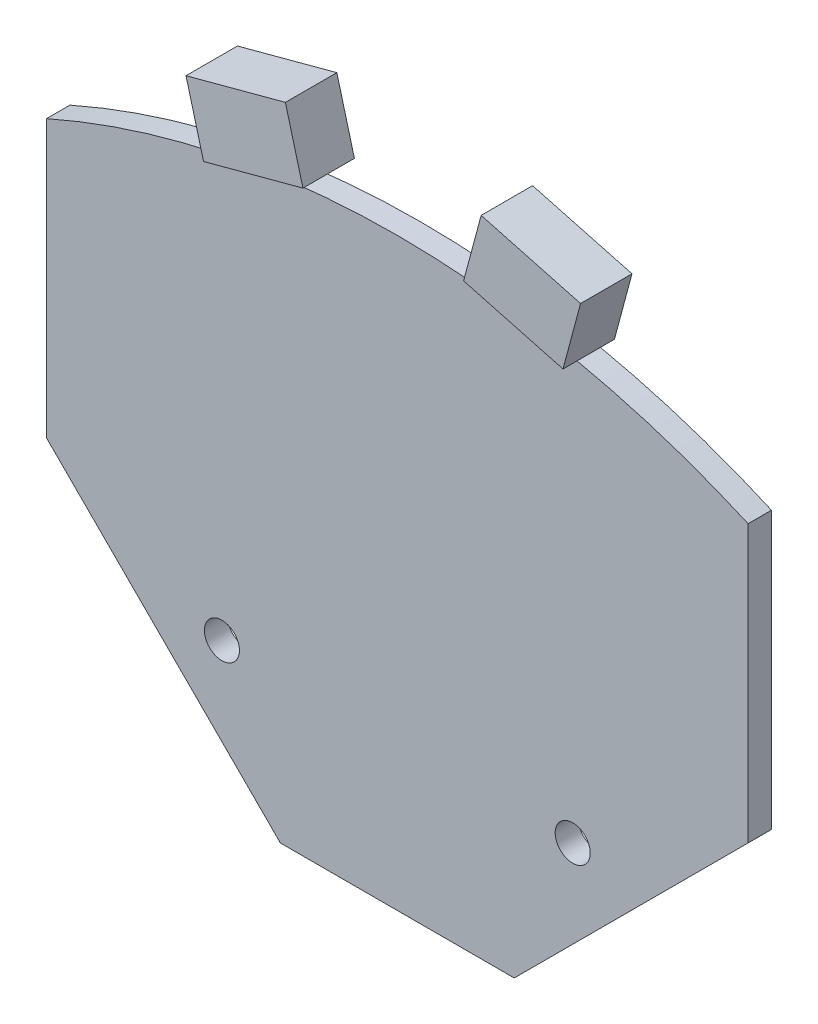
ISO-10303-21;
HEADER;
FILE_DESCRIPTION(('STEP AP214'),'2;1');
FILE_NAME('part.step','',(''),(''),'','','');
FILE_SCHEMA(('AUTOMOTIVE_DESIGN { 1 0 10303 214 1 1 1 1 }'));
ENDSEC;
DATA;
#1=APPLICATION_CONTEXT('core data for automotive mechanical design processes');
#2=APPLICATION_PROTOCOL_DEFINITION('international standard','automotive_design',2000,#1);
#3=PRODUCT_CONTEXT('',#1,'mechanical');
#4=PRODUCT('Part','Part','',(#3));
#5=PRODUCT_RELATED_PRODUCT_CATEGORY('part','',(#4));
#6=PRODUCT_DEFINITION_FORMATION('','',#4);
#7=PRODUCT_DEFINITION_CONTEXT('part definition',#1,'design');
#8=PRODUCT_DEFINITION('design','',#6,#7);
#9=PRODUCT_DEFINITION_SHAPE('','',#8);
#10=(LENGTH_UNIT() NAMED_UNIT(*) SI_UNIT(.MILLI.,.METRE.));
#11=(NAMED_UNIT(*) PLANE_ANGLE_UNIT() SI_UNIT($,.RADIAN.));
#12=(NAMED_UNIT(*) SI_UNIT($,.STERADIAN.) SOLID_ANGLE_UNIT());
#13=UNCERTAINTY_MEASURE_WITH_UNIT(LENGTH_MEASURE(1.E-05),#10,'distance_accuracy_value','');
#14=(GEOMETRIC_REPRESENTATION_CONTEXT(3) GLOBAL_UNCERTAINTY_ASSIGNED_CONTEXT((#13)) GLOBAL_UNIT_ASSIGNED_CONTEXT((#10,
#11,#12)) REPRESENTATION_CONTEXT('',''));
#15=CARTESIAN_POINT('',(0.,0.,0.));
#16=DIRECTION('',(0.,0.,1.));
#17=DIRECTION('',(1.,0.,0.));
#18=AXIS2_PLACEMENT_3D('',#15,#16,#17);
#19=CARTESIAN_POINT('',(40.,0.,2.));
#20=DIRECTION('',(1.,0.,0.));
#21=DIRECTION('',(0.,0.,-1.));
#22=AXIS2_PLACEMENT_3D('',#19,#20,#21);
#23=PLANE('',#22);
#24=DIRECTION('',(0.,-1.,0.));
#25=VECTOR('',#24,1.);
#26=CARTESIAN_POINT('',(40.,0.,0.));
#27=LINE('',#26,#25);
#28=CARTESIAN_POINT('',(40.,43.646138101151,0.));
#29=VERTEX_POINT('',#28);
#30=CARTESIAN_POINT('',(40.,20.,0.));
#31=VERTEX_POINT('',#30);
#32=EDGE_CURVE('E132',#29,#31,#27,.T.);
#33=ORIENTED_EDGE('',*,*,#32,.F.);
#34=DIRECTION('',(0.,0.,-1.));
#35=VECTOR('',#34,1.);
#36=CARTESIAN_POINT('',(40.,43.646138101151,2.));
#37=LINE('',#36,#35);
#38=CARTESIAN_POINT('',(40.,43.646138101151,2.));
#39=VERTEX_POINT('',#38);
#40=EDGE_CURVE('E12',#39,#29,#37,.T.);
#41=ORIENTED_EDGE('',*,*,#40,.F.);
#42=DIRECTION('',(0.,-1.,0.));
#43=VECTOR('',#42,1.);
#44=CARTESIAN_POINT('',(40.,0.,2.));
#45=LINE('',#44,#43);
#46=CARTESIAN_POINT('',(40.,20.,2.));
#47=VERTEX_POINT('',#46);
#48=EDGE_CURVE('E149',#39,#47,#45,.T.);
#49=ORIENTED_EDGE('',*,*,#48,.T.);
#50=DIRECTION('',(0.,0.,-1.));
#51=VECTOR('',#50,1.);
#52=CARTESIAN_POINT('',(40.,20.,2.));
#53=LINE('',#52,#51);
#54=EDGE_CURVE('E89',#47,#31,#53,.T.);
#55=ORIENTED_EDGE('',*,*,#54,.T.);
#56=EDGE_LOOP('',(#33,#41,#49,#55));
#57=FACE_BOUND('',#56,.T.);
#58=ADVANCED_FACE('F44',(#57),#23,.T.);
#59=CARTESIAN_POINT('',(10.,-24.,2.));
#60=DIRECTION('',(0.,0.,-1.));
#61=DIRECTION('',(-1.,0.,0.));
#62=AXIS2_PLACEMENT_3D('',#59,#60,#61);
#63=CYLINDRICAL_SURFACE('',#62,74.);
#64=CARTESIAN_POINT('',(10.,-24.,0.));
#65=DIRECTION('',(0.,0.,1.));
#66=DIRECTION('',(1.,0.,0.));
#67=AXIS2_PLACEMENT_3D('',#64,#65,#66);
#68=CIRCLE('',#67,74.);
#69=CARTESIAN_POINT('',(-20.,43.646138101151,0.));
#70=VERTEX_POINT('',#69);
#71=EDGE_CURVE('E135',#29,#70,#68,.T.);
#72=ORIENTED_EDGE('',*,*,#71,.T.);
#73=DIRECTION('',(0.,0.,-1.));
#74=VECTOR('',#73,1.);
#75=CARTESIAN_POINT('',(-20.,43.646138101151,2.));
#76=LINE('',#75,#74);
#77=CARTESIAN_POINT('',(-20.,43.646138101151,2.));
#78=VERTEX_POINT('',#77);
#79=EDGE_CURVE('E52',#78,#70,#76,.T.);
#80=ORIENTED_EDGE('',*,*,#79,.F.);
#81=CARTESIAN_POINT('',(10.,-24.,2.));
#82=DIRECTION('',(0.,0.,1.));
#83=DIRECTION('',(1.,0.,0.));
#84=AXIS2_PLACEMENT_3D('',#81,#82,#83);
#85=CIRCLE('',#84,74.);
#86=EDGE_CURVE('E165',#39,#78,#85,.T.);
#87=ORIENTED_EDGE('',*,*,#86,.F.);
#88=ORIENTED_EDGE('',*,*,#40,.T.);
#89=EDGE_LOOP('',(#72,#80,#87,#88));
#90=FACE_BOUND('',#89,.T.);
#91=ADVANCED_FACE('F168',(#90),#63,.T.);
#92=CARTESIAN_POINT('',(-20.,0.,2.));
#93=DIRECTION('',(1.,0.,0.));
#94=DIRECTION('',(0.,1.,0.));
#95=AXIS2_PLACEMENT_3D('',#92,#93,#94);
#96=PLANE('',#95);
#97=DIRECTION('',(0.,-1.,0.));
#98=VECTOR('',#97,1.);
#99=CARTESIAN_POINT('',(-20.,0.,0.));
#100=LINE('',#99,#98);
#101=CARTESIAN_POINT('',(-20.,20.,0.));
#102=VERTEX_POINT('',#101);
#103=EDGE_CURVE('E137',#70,#102,#100,.T.);
#104=ORIENTED_EDGE('',*,*,#103,.T.);
#105=DIRECTION('',(0.,0.,-1.));
#106=VECTOR('',#105,1.);
#107=CARTESIAN_POINT('',(-20.,20.,2.));
#108=LINE('',#107,#106);
#109=CARTESIAN_POINT('',(-20.,20.,2.));
#110=VERTEX_POINT('',#109);
#111=EDGE_CURVE('E118',#110,#102,#108,.T.);
#112=ORIENTED_EDGE('',*,*,#111,.F.);
#113=DIRECTION('',(0.,-1.,0.));
#114=VECTOR('',#113,1.);
#115=CARTESIAN_POINT('',(-20.,0.,2.));
#116=LINE('',#115,#114);
#117=EDGE_CURVE('E109',#78,#110,#116,.T.);
#118=ORIENTED_EDGE('',*,*,#117,.F.);
#119=ORIENTED_EDGE('',*,*,#79,.T.);
#120=EDGE_LOOP('',(#104,#112,#118,#119));
#121=FACE_BOUND('',#120,.T.);
#122=ADVANCED_FACE('F156',(#121),#96,.F.);
#123=CARTESIAN_POINT('',(0.,0.,2.));
#124=DIRECTION('',(0.707106781186547,0.707106781186547,0.));
#125=DIRECTION('',(-0.707106781186548,0.707106781186548,0.));
#126=AXIS2_PLACEMENT_3D('',#123,#124,#125);
#127=PLANE('',#126);
#128=DIRECTION('',(0.707106781186548,-0.707106781186548,0.));
#129=VECTOR('',#128,1.);
#130=CARTESIAN_POINT('',(0.,0.,0.));
#131=LINE('',#130,#129);
#132=CARTESIAN_POINT('',(0.,0.,0.));
#133=VERTEX_POINT('',#132);
#134=EDGE_CURVE('E117',#102,#133,#131,.T.);
#135=ORIENTED_EDGE('',*,*,#134,.T.);
#136=DIRECTION('',(0.,0.,-1.));
#137=VECTOR('',#136,1.);
#138=CARTESIAN_POINT('',(0.,0.,2.));
#139=LINE('',#138,#137);
#140=CARTESIAN_POINT('',(0.,0.,2.));
#141=VERTEX_POINT('',#140);
#142=EDGE_CURVE('E114',#141,#133,#139,.T.);
#143=ORIENTED_EDGE('',*,*,#142,.F.);
#144=DIRECTION('',(0.707106781186548,-0.707106781186548,0.));
#145=VECTOR('',#144,1.);
#146=CARTESIAN_POINT('',(0.,0.,2.));
#147=LINE('',#146,#145);
#148=EDGE_CURVE('E102',#110,#141,#147,.T.);
#149=ORIENTED_EDGE('',*,*,#148,.F.);
#150=ORIENTED_EDGE('',*,*,#111,.T.);
#151=EDGE_LOOP('',(#135,#143,#149,#150));
#152=FACE_BOUND('',#151,.T.);
#153=ADVANCED_FACE('F115',(#152),#127,.F.);
#154=CARTESIAN_POINT('',(0.,0.,2.));
#155=DIRECTION('',(0.,1.,0.));
#156=DIRECTION('',(0.,0.,1.));
#157=AXIS2_PLACEMENT_3D('',#154,#155,#156);
#158=PLANE('',#157);
#159=DIRECTION('',(1.,0.,0.));
#160=VECTOR('',#159,1.);
#161=CARTESIAN_POINT('',(0.,0.,0.));
#162=LINE('',#161,#160);
#163=CARTESIAN_POINT('',(20.,0.,0.));
#164=VERTEX_POINT('',#163);
#165=EDGE_CURVE('E82',#133,#164,#162,.T.);
#166=ORIENTED_EDGE('',*,*,#165,.T.);
#167=DIRECTION('',(0.,0.,-1.));
#168=VECTOR('',#167,1.);
#169=CARTESIAN_POINT('',(20.,0.,2.));
#170=LINE('',#169,#168);
#171=CARTESIAN_POINT('',(20.,0.,2.));
#172=VERTEX_POINT('',#171);
#173=EDGE_CURVE('E119',#172,#164,#170,.T.);
#174=ORIENTED_EDGE('',*,*,#173,.F.);
#175=DIRECTION('',(1.,0.,0.));
#176=VECTOR('',#175,1.);
#177=CARTESIAN_POINT('',(0.,0.,2.));
#178=LINE('',#177,#176);
#179=EDGE_CURVE('E107',#141,#172,#178,.T.);
#180=ORIENTED_EDGE('',*,*,#179,.F.);
#181=ORIENTED_EDGE('',*,*,#142,.T.);
#182=EDGE_LOOP('',(#166,#174,#180,#181));
#183=FACE_BOUND('',#182,.T.);
#184=ADVANCED_FACE('F121',(#183),#158,.F.);
#185=CARTESIAN_POINT('',(25.,12.5,2.));
#186=DIRECTION('',(0.,0.,-1.));
#187=DIRECTION('',(-1.,0.,0.));
#188=AXIS2_PLACEMENT_3D('',#185,#186,#187);
#189=CYLINDRICAL_SURFACE('',#188,1.5);
#190=CARTESIAN_POINT('',(25.,12.5,2.));
#191=DIRECTION('',(0.,0.,1.));
#192=DIRECTION('',(1.,0.,0.));
#193=AXIS2_PLACEMENT_3D('',#190,#191,#192);
#194=CIRCLE('',#193,1.5);
#195=CARTESIAN_POINT('',(26.5,12.5,2.));
#196=VERTEX_POINT('',#195);
#197=EDGE_CURVE('E123',#196,#196,#194,.T.);
#198=ORIENTED_EDGE('',*,*,#197,.T.);
#199=EDGE_LOOP('',(#198));
#200=FACE_BOUND('',#199,.T.);
#201=CARTESIAN_POINT('',(25.,12.5,0.));
#202=DIRECTION('',(0.,0.,1.));
#203=DIRECTION('',(1.,0.,0.));
#204=AXIS2_PLACEMENT_3D('',#201,#202,#203);
#205=CIRCLE('',#204,1.5);
#206=CARTESIAN_POINT('',(26.5,12.5,0.));
#207=VERTEX_POINT('',#206);
#208=EDGE_CURVE('E143',#207,#207,#205,.T.);
#209=ORIENTED_EDGE('',*,*,#208,.F.);
#210=EDGE_LOOP('',(#209));
#211=FACE_BOUND('',#210,.T.);
#212=ADVANCED_FACE('F180',(#200,#211),#189,.F.);
#213=CARTESIAN_POINT('',(10.,-10.,2.));
#214=DIRECTION('',(-0.707106781186547,0.707106781186547,0.));
#215=DIRECTION('',(-0.707106781186548,-0.707106781186548,0.));
#216=AXIS2_PLACEMENT_3D('',#213,#214,#215);
#217=PLANE('',#216);
#218=DIRECTION('',(0.707106781186548,0.707106781186548,0.));
#219=VECTOR('',#218,1.);
#220=CARTESIAN_POINT('',(10.,-10.,0.));
#221=LINE('',#220,#219);
#222=EDGE_CURVE('E141',#164,#31,#221,.T.);
#223=ORIENTED_EDGE('',*,*,#222,.T.);
#224=ORIENTED_EDGE('',*,*,#54,.F.);
#225=DIRECTION('',(0.707106781186548,0.707106781186548,0.));
#226=VECTOR('',#225,1.);
#227=CARTESIAN_POINT('',(10.,-10.,2.));
#228=LINE('',#227,#226);
#229=EDGE_CURVE('E60',#172,#47,#228,.T.);
#230=ORIENTED_EDGE('',*,*,#229,.F.);
#231=ORIENTED_EDGE('',*,*,#173,.T.);
#232=EDGE_LOOP('',(#223,#224,#230,#231));
#233=FACE_BOUND('',#232,.T.);
#234=ADVANCED_FACE('F164',(#233),#217,.F.);
#235=CARTESIAN_POINT('',(-5.00000000000009,12.5,2.));
#236=DIRECTION('',(0.,0.,-1.));
#237=DIRECTION('',(-1.,0.,0.));
#238=AXIS2_PLACEMENT_3D('',#235,#236,#237);
#239=CYLINDRICAL_SURFACE('',#238,1.5);
#240=CARTESIAN_POINT('',(-5.00000000000009,12.5,2.));
#241=DIRECTION('',(0.,0.,1.));
#242=DIRECTION('',(1.,0.,0.));
#243=AXIS2_PLACEMENT_3D('',#240,#241,#242);
#244=CIRCLE('',#243,1.5);
#245=CARTESIAN_POINT('',(-3.50000000000009,12.5,2.));
#246=VERTEX_POINT('',#245);
#247=EDGE_CURVE('E129',#246,#246,#244,.F.);
#248=ORIENTED_EDGE('',*,*,#247,.F.);
#249=EDGE_LOOP('',(#248));
#250=FACE_BOUND('',#249,.T.);
#251=CARTESIAN_POINT('',(-5.00000000000009,12.5,0.));
#252=DIRECTION('',(0.,0.,1.));
#253=DIRECTION('',(1.,0.,0.));
#254=AXIS2_PLACEMENT_3D('',#251,#252,#253);
#255=CIRCLE('',#254,1.5);
#256=CARTESIAN_POINT('',(-3.50000000000009,12.5,0.));
#257=VERTEX_POINT('',#256);
#258=EDGE_CURVE('E146',#257,#257,#255,.F.);
#259=ORIENTED_EDGE('',*,*,#258,.T.);
#260=EDGE_LOOP('',(#259));
#261=FACE_BOUND('',#260,.T.);
#262=ADVANCED_FACE('F183',(#250,#261),#239,.F.);
#263=CARTESIAN_POINT('',(0.,0.,2.));
#264=DIRECTION('',(0.,0.,1.));
#265=DIRECTION('',(1.,0.,0.));
#266=AXIS2_PLACEMENT_3D('',#263,#264,#265);
#267=PLANE('',#266);
#268=ORIENTED_EDGE('',*,*,#48,.F.);
#269=ORIENTED_EDGE('',*,*,#86,.T.);
#270=ORIENTED_EDGE('',*,*,#117,.T.);
#271=ORIENTED_EDGE('',*,*,#148,.T.);
#272=ORIENTED_EDGE('',*,*,#179,.T.);
#273=ORIENTED_EDGE('',*,*,#229,.T.);
#274=EDGE_LOOP('',(#268,#269,#270,#271,#272,#273));
#275=FACE_BOUND('',#274,.T.);
#276=ORIENTED_EDGE('',*,*,#197,.F.);
#277=EDGE_LOOP('',(#276));
#278=FACE_BOUND('',#277,.T.);
#279=ORIENTED_EDGE('',*,*,#247,.T.);
#280=EDGE_LOOP('',(#279));
#281=FACE_BOUND('',#280,.T.);
#282=ADVANCED_FACE('F104',(#275,#278,#281),#267,.T.);
#283=CARTESIAN_POINT('',(0.,0.,0.));
#284=DIRECTION('',(0.,0.,1.));
#285=DIRECTION('',(1.,0.,0.));
#286=AXIS2_PLACEMENT_3D('',#283,#284,#285);
#287=PLANE('',#286);
#288=ORIENTED_EDGE('',*,*,#32,.T.);
#289=ORIENTED_EDGE('',*,*,#222,.F.);
#290=ORIENTED_EDGE('',*,*,#165,.F.);
#291=ORIENTED_EDGE('',*,*,#134,.F.);
#292=ORIENTED_EDGE('',*,*,#103,.F.);
#293=ORIENTED_EDGE('',*,*,#71,.F.);
#294=EDGE_LOOP('',(#288,#289,#290,#291,#292,#293));
#295=FACE_BOUND('',#294,.T.);
#296=ORIENTED_EDGE('',*,*,#208,.T.);
#297=EDGE_LOOP('',(#296));
#298=FACE_BOUND('',#297,.T.);
#299=ORIENTED_EDGE('',*,*,#258,.F.);
#300=EDGE_LOOP('',(#299));
#301=FACE_BOUND('',#300,.T.);
#302=ADVANCED_FACE('F160',(#295,#298,#301),#287,.F.);
#303=CLOSED_SHELL('',(#58,#91,#122,#153,#184,#212,#234,#262,#282,#302));
#304=MANIFOLD_SOLID_BREP('B2',#303);
#305=CARTESIAN_POINT('',(25.3689968097492,48.3864209438616,-1.2));
#306=DIRECTION('',(0.965925826289068,-0.258819045102522,0.));
#307=DIRECTION('',(0.258819045102522,0.965925826289068,0.));
#308=AXIS2_PLACEMENT_3D('',#305,#306,#307);
#309=PLANE('',#308);
#310=DIRECTION('',(0.,0.,1.));
#311=VECTOR('',#310,1.);
#312=CARTESIAN_POINT('',(26.8701472713438,53.9887907363382,-1.2));
#313=LINE('',#312,#311);
#314=CARTESIAN_POINT('',(26.8701472713438,53.9887907363382,-1.2));
#315=VERTEX_POINT('',#314);
#316=CARTESIAN_POINT('',(26.8701472713438,53.9887907363382,3.2));
#317=VERTEX_POINT('',#316);
#318=EDGE_CURVE('E286',#315,#317,#313,.T.);
#319=ORIENTED_EDGE('',*,*,#318,.T.);
#320=DIRECTION('',(0.258819045102522,0.965925826289068,0.));
#321=VECTOR('',#320,1.);
#322=CARTESIAN_POINT('',(25.3689968097492,48.3864209438616,3.2));
#323=LINE('',#322,#321);
#324=CARTESIAN_POINT('',(25.3689968097492,48.3864209438616,3.2));
#325=VERTEX_POINT('',#324);
#326=EDGE_CURVE('E42',#325,#317,#323,.T.);
#327=ORIENTED_EDGE('',*,*,#326,.F.);
#328=DIRECTION('',(0.,0.,1.));
#329=VECTOR('',#328,1.);
#330=CARTESIAN_POINT('',(25.3689968097492,48.3864209438616,-1.2));
#331=LINE('',#330,#329);
#332=CARTESIAN_POINT('',(25.3689968097492,48.3864209438616,-1.2));
#333=VERTEX_POINT('',#332);
#334=EDGE_CURVE('E311',#333,#325,#331,.T.);
#335=ORIENTED_EDGE('',*,*,#334,.F.);
#336=DIRECTION('',(0.258819045102522,0.965925826289068,0.));
#337=VECTOR('',#336,1.);
#338=CARTESIAN_POINT('',(25.3689968097492,48.3864209438616,-1.2));
#339=LINE('',#338,#337);
#340=EDGE_CURVE('E314',#333,#315,#339,.T.);
#341=ORIENTED_EDGE('',*,*,#340,.T.);
#342=EDGE_LOOP('',(#319,#327,#335,#341));
#343=FACE_BOUND('',#342,.T.);
#344=ADVANCED_FACE('F271',(#343),#309,.T.);
#345=CARTESIAN_POINT('',(25.3689968097492,48.3864209438616,-1.2));
#346=DIRECTION('',(0.258819045102521,0.965925826289068,0.));
#347=DIRECTION('',(-0.965925826289068,0.258819045102521,0.));
#348=AXIS2_PLACEMENT_3D('',#345,#346,#347);
#349=PLANE('',#348);
#350=ORIENTED_EDGE('',*,*,#334,.T.);
#351=DIRECTION('',(-0.965925826289068,0.258819045102521,0.));
#352=VECTOR('',#351,1.);
#353=CARTESIAN_POINT('',(25.3689968097492,48.3864209438616,3.2));
#354=LINE('',#353,#352);
#355=CARTESIAN_POINT('',(16.8688495384054,50.6640285407638,3.2));
#356=VERTEX_POINT('',#355);
#357=EDGE_CURVE('E330',#325,#356,#354,.T.);
#358=ORIENTED_EDGE('',*,*,#357,.T.);
#359=DIRECTION('',(0.,0.,1.));
#360=VECTOR('',#359,1.);
#361=CARTESIAN_POINT('',(16.8688495384054,50.6640285407638,-1.2));
#362=LINE('',#361,#360);
#363=CARTESIAN_POINT('',(16.8688495384054,50.6640285407638,-1.2));
#364=VERTEX_POINT('',#363);
#365=EDGE_CURVE('E318',#364,#356,#362,.T.);
#366=ORIENTED_EDGE('',*,*,#365,.F.);
#367=DIRECTION('',(-0.965925826289068,0.258819045102521,0.));
#368=VECTOR('',#367,1.);
#369=CARTESIAN_POINT('',(25.3689968097492,48.3864209438616,-1.2));
#370=LINE('',#369,#368);
#371=EDGE_CURVE('E321',#333,#364,#370,.T.);
#372=ORIENTED_EDGE('',*,*,#371,.F.);
#373=EDGE_LOOP('',(#350,#358,#366,#372));
#374=FACE_BOUND('',#373,.T.);
#375=ADVANCED_FACE('F322',(#374),#349,.F.);
#376=CARTESIAN_POINT('',(16.8688495384054,50.6640285407638,-1.2));
#377=DIRECTION('',(0.965925826289068,-0.258819045102522,0.));
#378=DIRECTION('',(0.258819045102522,0.965925826289068,0.));
#379=AXIS2_PLACEMENT_3D('',#376,#377,#378);
#380=PLANE('',#379);
#381=ORIENTED_EDGE('',*,*,#365,.T.);
#382=DIRECTION('',(0.258819045102522,0.965925826289068,0.));
#383=VECTOR('',#382,1.);
#384=CARTESIAN_POINT('',(16.8688495384054,50.6640285407638,3.2));
#385=LINE('',#384,#383);
#386=CARTESIAN_POINT('',(18.37,56.2663983332403,3.2));
#387=VERTEX_POINT('',#386);
#388=EDGE_CURVE('E332',#356,#387,#385,.T.);
#389=ORIENTED_EDGE('',*,*,#388,.T.);
#390=DIRECTION('',(0.,0.,1.));
#391=VECTOR('',#390,1.);
#392=CARTESIAN_POINT('',(18.37,56.2663983332403,-1.2));
#393=LINE('',#392,#391);
#394=CARTESIAN_POINT('',(18.37,56.2663983332403,-1.2));
#395=VERTEX_POINT('',#394);
#396=EDGE_CURVE('E293',#395,#387,#393,.T.);
#397=ORIENTED_EDGE('',*,*,#396,.F.);
#398=DIRECTION('',(0.258819045102522,0.965925826289068,0.));
#399=VECTOR('',#398,1.);
#400=CARTESIAN_POINT('',(16.8688495384054,50.6640285407638,-1.2));
#401=LINE('',#400,#399);
#402=EDGE_CURVE('E325',#364,#395,#401,.T.);
#403=ORIENTED_EDGE('',*,*,#402,.F.);
#404=EDGE_LOOP('',(#381,#389,#397,#403));
#405=FACE_BOUND('',#404,.T.);
#406=ADVANCED_FACE('F341',(#405),#380,.F.);
#407=CARTESIAN_POINT('',(26.8701472713438,53.9887907363382,-1.2));
#408=DIRECTION('',(0.258819045102521,0.965925826289068,0.));
#409=DIRECTION('',(-0.965925826289068,0.258819045102521,0.));
#410=AXIS2_PLACEMENT_3D('',#407,#408,#409);
#411=PLANE('',#410);
#412=ORIENTED_EDGE('',*,*,#396,.T.);
#413=DIRECTION('',(-0.965925826289068,0.258819045102521,0.));
#414=VECTOR('',#413,1.);
#415=CARTESIAN_POINT('',(26.8701472713438,53.9887907363382,3.2));
#416=LINE('',#415,#414);
#417=EDGE_CURVE('E279',#317,#387,#416,.T.);
#418=ORIENTED_EDGE('',*,*,#417,.F.);
#419=ORIENTED_EDGE('',*,*,#318,.F.);
#420=DIRECTION('',(-0.965925826289068,0.258819045102521,0.));
#421=VECTOR('',#420,1.);
#422=CARTESIAN_POINT('',(26.8701472713438,53.9887907363382,-1.2));
#423=LINE('',#422,#421);
#424=EDGE_CURVE('E329',#315,#395,#423,.T.);
#425=ORIENTED_EDGE('',*,*,#424,.T.);
#426=EDGE_LOOP('',(#412,#418,#419,#425));
#427=FACE_BOUND('',#426,.T.);
#428=ADVANCED_FACE('F345',(#427),#411,.T.);
#429=CARTESIAN_POINT('',(0.,0.,-1.2));
#430=DIRECTION('',(0.,0.,1.));
#431=DIRECTION('',(1.,0.,0.));
#432=AXIS2_PLACEMENT_3D('',#429,#430,#431);
#433=PLANE('',#432);
#434=ORIENTED_EDGE('',*,*,#340,.F.);
#435=ORIENTED_EDGE('',*,*,#371,.T.);
#436=ORIENTED_EDGE('',*,*,#402,.T.);
#437=ORIENTED_EDGE('',*,*,#424,.F.);
#438=EDGE_LOOP('',(#434,#435,#436,#437));
#439=FACE_BOUND('',#438,.T.);
#440=ADVANCED_FACE('F328',(#439),#433,.F.);
#441=CARTESIAN_POINT('',(0.,0.,3.2));
#442=DIRECTION('',(0.,0.,1.));
#443=DIRECTION('',(1.,0.,0.));
#444=AXIS2_PLACEMENT_3D('',#441,#442,#443);
#445=PLANE('',#444);
#446=ORIENTED_EDGE('',*,*,#326,.T.);
#447=ORIENTED_EDGE('',*,*,#417,.T.);
#448=ORIENTED_EDGE('',*,*,#388,.F.);
#449=ORIENTED_EDGE('',*,*,#357,.F.);
#450=EDGE_LOOP('',(#446,#447,#448,#449));
#451=FACE_BOUND('',#450,.T.);
#452=ADVANCED_FACE('F273',(#451),#445,.T.);
#453=CLOSED_SHELL('',(#344,#375,#406,#428,#440,#452));
#454=MANIFOLD_SOLID_BREP('B6',#453);
#455=CARTESIAN_POINT('',(-13.957410287394,52.0897643346406,-1.2));
#456=DIRECTION('',(-0.258819045102514,0.96592582628907,0.));
#457=DIRECTION('',(-0.96592582628907,-0.258819045102514,0.));
#458=AXIS2_PLACEMENT_3D('',#455,#456,#457);
#459=PLANE('',#458);
#460=DIRECTION('',(0.,0.,1.));
#461=VECTOR('',#460,1.);
#462=CARTESIAN_POINT('',(-6.87014727134339,53.9887907363383,-1.2));
#463=LINE('',#462,#461);
#464=CARTESIAN_POINT('',(-6.87014727134339,53.9887907363383,-1.2));
#465=VERTEX_POINT('',#464);
#466=CARTESIAN_POINT('',(-6.87014727134339,53.9887907363383,3.2));
#467=VERTEX_POINT('',#466);
#468=EDGE_CURVE('E394',#465,#467,#463,.T.);
#469=ORIENTED_EDGE('',*,*,#468,.T.);
#470=DIRECTION('',(-0.96592582628907,-0.258819045102514,0.));
#471=VECTOR('',#470,1.);
#472=CARTESIAN_POINT('',(-13.957410287394,52.0897643346406,3.2));
#473=LINE('',#472,#471);
#474=CARTESIAN_POINT('',(1.63000000000042,56.2663983332404,3.2));
#475=VERTEX_POINT('',#474);
#476=EDGE_CURVE('E431',#475,#467,#473,.T.);
#477=ORIENTED_EDGE('',*,*,#476,.F.);
#478=DIRECTION('',(0.,0.,1.));
#479=VECTOR('',#478,1.);
#480=CARTESIAN_POINT('',(1.63000000000042,56.2663983332404,-1.2));
#481=LINE('',#480,#479);
#482=CARTESIAN_POINT('',(1.63000000000042,56.2663983332404,-1.2));
#483=VERTEX_POINT('',#482);
#484=EDGE_CURVE('E269',#483,#475,#481,.T.);
#485=ORIENTED_EDGE('',*,*,#484,.F.);
#486=DIRECTION('',(-0.96592582628907,-0.258819045102514,0.));
#487=VECTOR('',#486,1.);
#488=CARTESIAN_POINT('',(-13.957410287394,52.0897643346406,-1.2));
#489=LINE('',#488,#487);
#490=EDGE_CURVE('E433',#483,#465,#489,.T.);
#491=ORIENTED_EDGE('',*,*,#490,.T.);
#492=EDGE_LOOP('',(#469,#477,#485,#491));
#493=FACE_BOUND('',#492,.T.);
#494=ADVANCED_FACE('F391',(#493),#459,.T.);
#495=CARTESIAN_POINT('',(15.5874102873945,4.17663399859982,-1.2));
#496=DIRECTION('',(-0.96592582628907,-0.258819045102514,0.));
#497=DIRECTION('',(0.258819045102514,-0.96592582628907,0.));
#498=AXIS2_PLACEMENT_3D('',#495,#496,#497);
#499=PLANE('',#498);
#500=ORIENTED_EDGE('',*,*,#484,.T.);
#501=DIRECTION('',(0.258819045102514,-0.96592582628907,0.));
#502=VECTOR('',#501,1.);
#503=CARTESIAN_POINT('',(15.5874102873945,4.17663399859982,3.2));
#504=LINE('',#503,#502);
#505=CARTESIAN_POINT('',(3.13115046159501,50.6640285407638,3.2));
#506=VERTEX_POINT('',#505);
#507=EDGE_CURVE('E449',#475,#506,#504,.T.);
#508=ORIENTED_EDGE('',*,*,#507,.T.);
#509=DIRECTION('',(0.,0.,1.));
#510=VECTOR('',#509,1.);
#511=CARTESIAN_POINT('',(3.13115046159501,50.6640285407638,-1.2));
#512=LINE('',#511,#510);
#513=CARTESIAN_POINT('',(3.13115046159501,50.6640285407638,-1.2));
#514=VERTEX_POINT('',#513);
#515=EDGE_CURVE('E399',#514,#506,#512,.T.);
#516=ORIENTED_EDGE('',*,*,#515,.F.);
#517=DIRECTION('',(0.258819045102514,-0.96592582628907,0.));
#518=VECTOR('',#517,1.);
#519=CARTESIAN_POINT('',(15.5874102873945,4.17663399859982,-1.2));
#520=LINE('',#519,#518);
#521=EDGE_CURVE('E412',#483,#514,#520,.T.);
#522=ORIENTED_EDGE('',*,*,#521,.F.);
#523=EDGE_LOOP('',(#500,#508,#516,#522));
#524=FACE_BOUND('',#523,.T.);
#525=ADVANCED_FACE('F464',(#524),#499,.F.);
#526=CARTESIAN_POINT('',(-12.4562598257995,46.4873945421639,-1.2));
#527=DIRECTION('',(-0.258819045102514,0.96592582628907,0.));
#528=DIRECTION('',(-0.96592582628907,-0.258819045102514,0.));
#529=AXIS2_PLACEMENT_3D('',#526,#527,#528);
#530=PLANE('',#529);
#531=ORIENTED_EDGE('',*,*,#515,.T.);
#532=DIRECTION('',(-0.96592582628907,-0.258819045102514,0.));
#533=VECTOR('',#532,1.);
#534=CARTESIAN_POINT('',(-12.4562598257995,46.4873945421639,3.2));
#535=LINE('',#534,#533);
#536=CARTESIAN_POINT('',(-5.36899680974881,48.3864209438616,3.2));
#537=VERTEX_POINT('',#536);
#538=EDGE_CURVE('E445',#506,#537,#535,.T.);
#539=ORIENTED_EDGE('',*,*,#538,.T.);
#540=DIRECTION('',(0.,0.,1.));
#541=VECTOR('',#540,1.);
#542=CARTESIAN_POINT('',(-5.36899680974881,48.3864209438616,-1.2));
#543=LINE('',#542,#541);
#544=CARTESIAN_POINT('',(-5.36899680974881,48.3864209438616,-1.2));
#545=VERTEX_POINT('',#544);
#546=EDGE_CURVE('E437',#545,#537,#543,.T.);
#547=ORIENTED_EDGE('',*,*,#546,.F.);
#548=DIRECTION('',(-0.96592582628907,-0.258819045102514,0.));
#549=VECTOR('',#548,1.);
#550=CARTESIAN_POINT('',(-12.4562598257995,46.4873945421639,-1.2));
#551=LINE('',#550,#549);
#552=EDGE_CURVE('E457',#514,#545,#551,.T.);
#553=ORIENTED_EDGE('',*,*,#552,.F.);
#554=EDGE_LOOP('',(#531,#539,#547,#553));
#555=FACE_BOUND('',#554,.T.);
#556=ADVANCED_FACE('F462',(#555),#530,.F.);
#557=CARTESIAN_POINT('',(7.08726301605066,1.89902640169769,-1.2));
#558=DIRECTION('',(-0.96592582628907,-0.258819045102514,0.));
#559=DIRECTION('',(0.258819045102514,-0.96592582628907,0.));
#560=AXIS2_PLACEMENT_3D('',#557,#558,#559);
#561=PLANE('',#560);
#562=ORIENTED_EDGE('',*,*,#546,.T.);
#563=DIRECTION('',(0.258819045102514,-0.96592582628907,0.));
#564=VECTOR('',#563,1.);
#565=CARTESIAN_POINT('',(7.08726301605066,1.89902640169769,3.2));
#566=LINE('',#565,#564);
#567=EDGE_CURVE('E439',#467,#537,#566,.T.);
#568=ORIENTED_EDGE('',*,*,#567,.F.);
#569=ORIENTED_EDGE('',*,*,#468,.F.);
#570=DIRECTION('',(0.258819045102514,-0.96592582628907,0.));
#571=VECTOR('',#570,1.);
#572=CARTESIAN_POINT('',(7.08726301605066,1.89902640169769,-1.2));
#573=LINE('',#572,#571);
#574=EDGE_CURVE('E455',#465,#545,#573,.T.);
#575=ORIENTED_EDGE('',*,*,#574,.T.);
#576=EDGE_LOOP('',(#562,#568,#569,#575));
#577=FACE_BOUND('',#576,.T.);
#578=ADVANCED_FACE('F440',(#577),#561,.T.);
#579=CARTESIAN_POINT('',(0.,0.,-1.2));
#580=DIRECTION('',(0.,0.,1.));
#581=DIRECTION('',(1.,0.,0.));
#582=AXIS2_PLACEMENT_3D('',#579,#580,#581);
#583=PLANE('',#582);
#584=ORIENTED_EDGE('',*,*,#490,.F.);
#585=ORIENTED_EDGE('',*,*,#521,.T.);
#586=ORIENTED_EDGE('',*,*,#552,.T.);
#587=ORIENTED_EDGE('',*,*,#574,.F.);
#588=EDGE_LOOP('',(#584,#585,#586,#587));
#589=FACE_BOUND('',#588,.T.);
#590=ADVANCED_FACE('F465',(#589),#583,.F.);
#591=CARTESIAN_POINT('',(0.,0.,3.2));
#592=DIRECTION('',(0.,0.,1.));
#593=DIRECTION('',(1.,0.,0.));
#594=AXIS2_PLACEMENT_3D('',#591,#592,#593);
#595=PLANE('',#594);
#596=ORIENTED_EDGE('',*,*,#476,.T.);
#597=ORIENTED_EDGE('',*,*,#567,.T.);
#598=ORIENTED_EDGE('',*,*,#538,.F.);
#599=ORIENTED_EDGE('',*,*,#507,.F.);
#600=EDGE_LOOP('',(#596,#597,#598,#599));
#601=FACE_BOUND('',#600,.T.);
#602=ADVANCED_FACE('F447',(#601),#595,.T.);
#603=CLOSED_SHELL('',(#494,#525,#556,#578,#590,#602));
#604=MANIFOLD_SOLID_BREP('B36',#603);
#605=ADVANCED_BREP_SHAPE_REPRESENTATION('',(#18,#304,#454,#604),#14);
#606=SHAPE_DEFINITION_REPRESENTATION(#9,#605);
ENDSEC;
END-ISO-10303-21;
